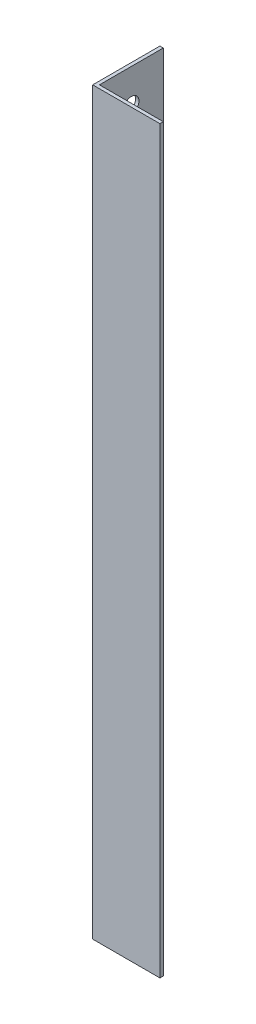
ISO-10303-21;
HEADER;
FILE_DESCRIPTION(('STEP AP214'),'2;1');
FILE_NAME('part.step','',(''),(''),'','','');
FILE_SCHEMA(('AUTOMOTIVE_DESIGN { 1 0 10303 214 1 1 1 1 }'));
ENDSEC;
DATA;
#1=APPLICATION_CONTEXT('core data for automotive mechanical design processes');
#2=APPLICATION_PROTOCOL_DEFINITION('international standard','automotive_design',2000,#1);
#3=PRODUCT_CONTEXT('',#1,'mechanical');
#4=PRODUCT('Part','Part','',(#3));
#5=PRODUCT_RELATED_PRODUCT_CATEGORY('part','',(#4));
#6=PRODUCT_DEFINITION_FORMATION('','',#4);
#7=PRODUCT_DEFINITION_CONTEXT('part definition',#1,'design');
#8=PRODUCT_DEFINITION('design','',#6,#7);
#9=PRODUCT_DEFINITION_SHAPE('','',#8);
#10=(LENGTH_UNIT() NAMED_UNIT(*) SI_UNIT(.MILLI.,.METRE.));
#11=(NAMED_UNIT(*) PLANE_ANGLE_UNIT() SI_UNIT($,.RADIAN.));
#12=(NAMED_UNIT(*) SI_UNIT($,.STERADIAN.) SOLID_ANGLE_UNIT());
#13=UNCERTAINTY_MEASURE_WITH_UNIT(LENGTH_MEASURE(1.E-05),#10,'distance_accuracy_value','');
#14=(GEOMETRIC_REPRESENTATION_CONTEXT(3) GLOBAL_UNCERTAINTY_ASSIGNED_CONTEXT((#13)) GLOBAL_UNIT_ASSIGNED_CONTEXT((#10,
#11,#12)) REPRESENTATION_CONTEXT('',''));
#15=CARTESIAN_POINT('',(0.,0.,0.));
#16=DIRECTION('',(0.,0.,1.));
#17=DIRECTION('',(1.,0.,0.));
#18=AXIS2_PLACEMENT_3D('',#15,#16,#17);
#19=CARTESIAN_POINT('',(20.,220.,0.));
#20=DIRECTION('',(0.,0.,-1.));
#21=DIRECTION('',(-1.,0.,0.));
#22=AXIS2_PLACEMENT_3D('',#19,#20,#21);
#23=PLANE('',#22);
#24=DIRECTION('',(1.,0.,0.));
#25=VECTOR('',#24,1.);
#26=CARTESIAN_POINT('',(20.,0.,0.));
#27=LINE('',#26,#25);
#28=CARTESIAN_POINT('',(0.,0.,0.));
#29=VERTEX_POINT('',#28);
#30=CARTESIAN_POINT('',(20.,0.,0.));
#31=VERTEX_POINT('',#30);
#32=EDGE_CURVE('E123',#29,#31,#27,.T.);
#33=ORIENTED_EDGE('',*,*,#32,.T.);
#34=DIRECTION('',(0.,-1.,0.));
#35=VECTOR('',#34,1.);
#36=CARTESIAN_POINT('',(20.,220.,0.));
#37=LINE('',#36,#35);
#38=CARTESIAN_POINT('',(20.,220.,0.));
#39=VERTEX_POINT('',#38);
#40=EDGE_CURVE('E11',#39,#31,#37,.T.);
#41=ORIENTED_EDGE('',*,*,#40,.F.);
#42=DIRECTION('',(1.,0.,0.));
#43=VECTOR('',#42,1.);
#44=CARTESIAN_POINT('',(20.,220.,0.));
#45=LINE('',#44,#43);
#46=CARTESIAN_POINT('',(0.,220.,0.));
#47=VERTEX_POINT('',#46);
#48=EDGE_CURVE('E134',#47,#39,#45,.T.);
#49=ORIENTED_EDGE('',*,*,#48,.F.);
#50=DIRECTION('',(0.,-1.,0.));
#51=VECTOR('',#50,1.);
#52=CARTESIAN_POINT('',(0.,220.,0.));
#53=LINE('',#52,#51);
#54=EDGE_CURVE('E119',#47,#29,#53,.T.);
#55=ORIENTED_EDGE('',*,*,#54,.T.);
#56=EDGE_LOOP('',(#33,#41,#49,#55));
#57=FACE_BOUND('',#56,.T.);
#58=ADVANCED_FACE('F39',(#57),#23,.F.);
#59=CARTESIAN_POINT('',(20.,220.,-1.));
#60=DIRECTION('',(-1.,0.,0.));
#61=DIRECTION('',(0.,0.,1.));
#62=AXIS2_PLACEMENT_3D('',#59,#60,#61);
#63=PLANE('',#62);
#64=DIRECTION('',(0.,0.,-1.));
#65=VECTOR('',#64,1.);
#66=CARTESIAN_POINT('',(20.,0.,-1.));
#67=LINE('',#66,#65);
#68=CARTESIAN_POINT('',(20.,0.,-1.));
#69=VERTEX_POINT('',#68);
#70=EDGE_CURVE('E126',#31,#69,#67,.T.);
#71=ORIENTED_EDGE('',*,*,#70,.T.);
#72=DIRECTION('',(0.,-1.,0.));
#73=VECTOR('',#72,1.);
#74=CARTESIAN_POINT('',(20.,220.,-1.));
#75=LINE('',#74,#73);
#76=CARTESIAN_POINT('',(20.,220.,-1.));
#77=VERTEX_POINT('',#76);
#78=EDGE_CURVE('E47',#77,#69,#75,.T.);
#79=ORIENTED_EDGE('',*,*,#78,.F.);
#80=DIRECTION('',(0.,0.,-1.));
#81=VECTOR('',#80,1.);
#82=CARTESIAN_POINT('',(20.,220.,-1.));
#83=LINE('',#82,#81);
#84=EDGE_CURVE('E92',#39,#77,#83,.T.);
#85=ORIENTED_EDGE('',*,*,#84,.F.);
#86=ORIENTED_EDGE('',*,*,#40,.T.);
#87=EDGE_LOOP('',(#71,#79,#85,#86));
#88=FACE_BOUND('',#87,.T.);
#89=ADVANCED_FACE('F161',(#88),#63,.F.);
#90=CARTESIAN_POINT('',(1.00000000000001,220.,-1.));
#91=DIRECTION('',(0.,0.,1.));
#92=DIRECTION('',(1.,0.,0.));
#93=AXIS2_PLACEMENT_3D('',#90,#91,#92);
#94=PLANE('',#93);
#95=DIRECTION('',(-1.,0.,0.));
#96=VECTOR('',#95,1.);
#97=CARTESIAN_POINT('',(1.,0.,-1.));
#98=LINE('',#97,#96);
#99=CARTESIAN_POINT('',(1.,0.,-1.));
#100=VERTEX_POINT('',#99);
#101=EDGE_CURVE('E129',#69,#100,#98,.T.);
#102=ORIENTED_EDGE('',*,*,#101,.T.);
#103=DIRECTION('',(0.,-1.,0.));
#104=VECTOR('',#103,1.);
#105=CARTESIAN_POINT('',(1.00000000000001,220.,-1.));
#106=LINE('',#105,#104);
#107=CARTESIAN_POINT('',(1.00000000000001,220.,-1.));
#108=VERTEX_POINT('',#107);
#109=EDGE_CURVE('E114',#108,#100,#106,.T.);
#110=ORIENTED_EDGE('',*,*,#109,.F.);
#111=DIRECTION('',(-1.,0.,0.));
#112=VECTOR('',#111,1.);
#113=CARTESIAN_POINT('',(1.00000000000001,220.,-1.));
#114=LINE('',#113,#112);
#115=EDGE_CURVE('E105',#77,#108,#114,.T.);
#116=ORIENTED_EDGE('',*,*,#115,.F.);
#117=ORIENTED_EDGE('',*,*,#78,.T.);
#118=EDGE_LOOP('',(#102,#110,#116,#117));
#119=FACE_BOUND('',#118,.T.);
#120=ADVANCED_FACE('F140',(#119),#94,.F.);
#121=CARTESIAN_POINT('',(1.00000000000001,220.,-20.));
#122=DIRECTION('',(-1.,0.,0.));
#123=DIRECTION('',(0.,0.,1.));
#124=AXIS2_PLACEMENT_3D('',#121,#122,#123);
#125=PLANE('',#124);
#126=CARTESIAN_POINT('',(0.999999999999997,9.99999999999993,-10.5));
#127=DIRECTION('',(1.,0.,0.));
#128=DIRECTION('',(0.,0.,-1.));
#129=AXIS2_PLACEMENT_3D('',#126,#127,#128);
#130=CIRCLE('',#129,2.24999999999995);
#131=CARTESIAN_POINT('',(0.999999999999997,9.99999999999993,-12.75));
#132=VERTEX_POINT('',#131);
#133=EDGE_CURVE('E177',#132,#132,#130,.T.);
#134=ORIENTED_EDGE('',*,*,#133,.F.);
#135=EDGE_LOOP('',(#134));
#136=FACE_BOUND('',#135,.T.);
#137=CARTESIAN_POINT('',(1.00000000000001,210.,-10.5));
#138=DIRECTION('',(1.,0.,0.));
#139=DIRECTION('',(0.,0.,-1.));
#140=AXIS2_PLACEMENT_3D('',#137,#138,#139);
#141=CIRCLE('',#140,2.25);
#142=CARTESIAN_POINT('',(1.00000000000001,210.,-12.75));
#143=VERTEX_POINT('',#142);
#144=EDGE_CURVE('E181',#143,#143,#141,.T.);
#145=ORIENTED_EDGE('',*,*,#144,.F.);
#146=EDGE_LOOP('',(#145));
#147=FACE_BOUND('',#146,.T.);
#148=CARTESIAN_POINT('',(1.,60.,-10.5));
#149=DIRECTION('',(1.,0.,0.));
#150=DIRECTION('',(0.,0.,-1.));
#151=AXIS2_PLACEMENT_3D('',#148,#149,#150);
#152=CIRCLE('',#151,4.25000000000001);
#153=CARTESIAN_POINT('',(1.,60.,-14.75));
#154=VERTEX_POINT('',#153);
#155=EDGE_CURVE('E185',#154,#154,#152,.T.);
#156=ORIENTED_EDGE('',*,*,#155,.F.);
#157=EDGE_LOOP('',(#156));
#158=FACE_BOUND('',#157,.T.);
#159=CARTESIAN_POINT('',(1.00000000000001,120.,-10.5));
#160=DIRECTION('',(1.,0.,0.));
#161=DIRECTION('',(0.,0.,-1.));
#162=AXIS2_PLACEMENT_3D('',#159,#160,#161);
#163=CIRCLE('',#162,4.25000000000001);
#164=CARTESIAN_POINT('',(1.00000000000001,120.,-14.75));
#165=VERTEX_POINT('',#164);
#166=EDGE_CURVE('E189',#165,#165,#163,.T.);
#167=ORIENTED_EDGE('',*,*,#166,.F.);
#168=EDGE_LOOP('',(#167));
#169=FACE_BOUND('',#168,.T.);
#170=CARTESIAN_POINT('',(1.00000000000001,180.,-10.5));
#171=DIRECTION('',(1.,0.,0.));
#172=DIRECTION('',(0.,0.,-1.));
#173=AXIS2_PLACEMENT_3D('',#170,#171,#172);
#174=CIRCLE('',#173,4.25000000000001);
#175=CARTESIAN_POINT('',(1.00000000000001,180.,-14.75));
#176=VERTEX_POINT('',#175);
#177=EDGE_CURVE('E192',#176,#176,#174,.T.);
#178=ORIENTED_EDGE('',*,*,#177,.F.);
#179=EDGE_LOOP('',(#178));
#180=FACE_BOUND('',#179,.T.);
#181=DIRECTION('',(0.,0.,-1.));
#182=VECTOR('',#181,1.);
#183=CARTESIAN_POINT('',(0.999999999999997,0.,-20.));
#184=LINE('',#183,#182);
#185=CARTESIAN_POINT('',(0.999999999999997,0.,-20.));
#186=VERTEX_POINT('',#185);
#187=EDGE_CURVE('E113',#100,#186,#184,.T.);
#188=ORIENTED_EDGE('',*,*,#187,.T.);
#189=DIRECTION('',(0.,-1.,0.));
#190=VECTOR('',#189,1.);
#191=CARTESIAN_POINT('',(1.00000000000001,220.,-20.));
#192=LINE('',#191,#190);
#193=CARTESIAN_POINT('',(1.00000000000001,220.,-20.));
#194=VERTEX_POINT('',#193);
#195=EDGE_CURVE('E110',#194,#186,#192,.T.);
#196=ORIENTED_EDGE('',*,*,#195,.F.);
#197=DIRECTION('',(0.,0.,-1.));
#198=VECTOR('',#197,1.);
#199=CARTESIAN_POINT('',(1.00000000000001,220.,-20.));
#200=LINE('',#199,#198);
#201=EDGE_CURVE('E99',#108,#194,#200,.T.);
#202=ORIENTED_EDGE('',*,*,#201,.F.);
#203=ORIENTED_EDGE('',*,*,#109,.T.);
#204=EDGE_LOOP('',(#188,#196,#202,#203));
#205=FACE_BOUND('',#204,.T.);
#206=ADVANCED_FACE('F111',(#136,#147,#158,#169,#180,#205),#125,.F.);
#207=CARTESIAN_POINT('',(0.,220.,-20.));
#208=DIRECTION('',(0.,0.,1.));
#209=DIRECTION('',(1.,0.,0.));
#210=AXIS2_PLACEMENT_3D('',#207,#208,#209);
#211=PLANE('',#210);
#212=DIRECTION('',(-1.,0.,0.));
#213=VECTOR('',#212,1.);
#214=CARTESIAN_POINT('',(0.,0.,-20.));
#215=LINE('',#214,#213);
#216=CARTESIAN_POINT('',(0.,0.,-20.));
#217=VERTEX_POINT('',#216);
#218=EDGE_CURVE('E78',#186,#217,#215,.T.);
#219=ORIENTED_EDGE('',*,*,#218,.T.);
#220=DIRECTION('',(0.,-1.,0.));
#221=VECTOR('',#220,1.);
#222=CARTESIAN_POINT('',(0.,220.,-20.));
#223=LINE('',#222,#221);
#224=CARTESIAN_POINT('',(0.,220.,-20.));
#225=VERTEX_POINT('',#224);
#226=EDGE_CURVE('E115',#225,#217,#223,.T.);
#227=ORIENTED_EDGE('',*,*,#226,.F.);
#228=DIRECTION('',(-1.,0.,0.));
#229=VECTOR('',#228,1.);
#230=CARTESIAN_POINT('',(0.,220.,-20.));
#231=LINE('',#230,#229);
#232=EDGE_CURVE('E103',#194,#225,#231,.T.);
#233=ORIENTED_EDGE('',*,*,#232,.F.);
#234=ORIENTED_EDGE('',*,*,#195,.T.);
#235=EDGE_LOOP('',(#219,#227,#233,#234));
#236=FACE_BOUND('',#235,.T.);
#237=ADVANCED_FACE('F117',(#236),#211,.F.);
#238=CARTESIAN_POINT('',(0.,220.,0.));
#239=DIRECTION('',(1.,0.,0.));
#240=DIRECTION('',(0.,0.,-1.));
#241=AXIS2_PLACEMENT_3D('',#238,#239,#240);
#242=PLANE('',#241);
#243=CARTESIAN_POINT('',(0.,9.99999999999993,-10.5));
#244=DIRECTION('',(1.,0.,0.));
#245=DIRECTION('',(0.,0.,-1.));
#246=AXIS2_PLACEMENT_3D('',#243,#244,#245);
#247=CIRCLE('',#246,2.24999999999995);
#248=CARTESIAN_POINT('',(0.,9.99999999999993,-12.75));
#249=VERTEX_POINT('',#248);
#250=EDGE_CURVE('E210',#249,#249,#247,.T.);
#251=ORIENTED_EDGE('',*,*,#250,.T.);
#252=EDGE_LOOP('',(#251));
#253=FACE_BOUND('',#252,.T.);
#254=CARTESIAN_POINT('',(0.,210.,-10.5));
#255=DIRECTION('',(1.,0.,0.));
#256=DIRECTION('',(0.,0.,-1.));
#257=AXIS2_PLACEMENT_3D('',#254,#255,#256);
#258=CIRCLE('',#257,2.25);
#259=CARTESIAN_POINT('',(0.,210.,-12.75));
#260=VERTEX_POINT('',#259);
#261=EDGE_CURVE('E206',#260,#260,#258,.T.);
#262=ORIENTED_EDGE('',*,*,#261,.T.);
#263=EDGE_LOOP('',(#262));
#264=FACE_BOUND('',#263,.T.);
#265=CARTESIAN_POINT('',(0.,60.,-10.5));
#266=DIRECTION('',(1.,0.,0.));
#267=DIRECTION('',(0.,0.,-1.));
#268=AXIS2_PLACEMENT_3D('',#265,#266,#267);
#269=CIRCLE('',#268,4.25000000000001);
#270=CARTESIAN_POINT('',(0.,60.,-14.75));
#271=VERTEX_POINT('',#270);
#272=EDGE_CURVE('E203',#271,#271,#269,.T.);
#273=ORIENTED_EDGE('',*,*,#272,.T.);
#274=EDGE_LOOP('',(#273));
#275=FACE_BOUND('',#274,.T.);
#276=CARTESIAN_POINT('',(0.,120.,-10.5));
#277=DIRECTION('',(1.,0.,0.));
#278=DIRECTION('',(0.,0.,-1.));
#279=AXIS2_PLACEMENT_3D('',#276,#277,#278);
#280=CIRCLE('',#279,4.25000000000001);
#281=CARTESIAN_POINT('',(0.,120.,-14.75));
#282=VERTEX_POINT('',#281);
#283=EDGE_CURVE('E194',#282,#282,#280,.T.);
#284=ORIENTED_EDGE('',*,*,#283,.T.);
#285=EDGE_LOOP('',(#284));
#286=FACE_BOUND('',#285,.T.);
#287=CARTESIAN_POINT('',(0.,180.,-10.5));
#288=DIRECTION('',(1.,0.,0.));
#289=DIRECTION('',(0.,0.,-1.));
#290=AXIS2_PLACEMENT_3D('',#287,#288,#289);
#291=CIRCLE('',#290,4.25000000000001);
#292=CARTESIAN_POINT('',(0.,180.,-14.75));
#293=VERTEX_POINT('',#292);
#294=EDGE_CURVE('E127',#293,#293,#291,.T.);
#295=ORIENTED_EDGE('',*,*,#294,.T.);
#296=EDGE_LOOP('',(#295));
#297=FACE_BOUND('',#296,.T.);
#298=DIRECTION('',(0.,0.,1.));
#299=VECTOR('',#298,1.);
#300=CARTESIAN_POINT('',(0.,0.,0.));
#301=LINE('',#300,#299);
#302=EDGE_CURVE('E84',#217,#29,#301,.T.);
#303=ORIENTED_EDGE('',*,*,#302,.T.);
#304=ORIENTED_EDGE('',*,*,#54,.F.);
#305=DIRECTION('',(0.,0.,1.));
#306=VECTOR('',#305,1.);
#307=CARTESIAN_POINT('',(0.,220.,0.));
#308=LINE('',#307,#306);
#309=EDGE_CURVE('E55',#225,#47,#308,.T.);
#310=ORIENTED_EDGE('',*,*,#309,.F.);
#311=ORIENTED_EDGE('',*,*,#226,.T.);
#312=EDGE_LOOP('',(#303,#304,#310,#311));
#313=FACE_BOUND('',#312,.T.);
#314=ADVANCED_FACE('F147',(#253,#264,#275,#286,#297,#313),#242,.F.);
#315=CARTESIAN_POINT('',(0.,220.,0.));
#316=DIRECTION('',(0.,-1.,0.));
#317=DIRECTION('',(0.,0.,-1.));
#318=AXIS2_PLACEMENT_3D('',#315,#316,#317);
#319=PLANE('',#318);
#320=ORIENTED_EDGE('',*,*,#48,.T.);
#321=ORIENTED_EDGE('',*,*,#84,.T.);
#322=ORIENTED_EDGE('',*,*,#115,.T.);
#323=ORIENTED_EDGE('',*,*,#201,.T.);
#324=ORIENTED_EDGE('',*,*,#232,.T.);
#325=ORIENTED_EDGE('',*,*,#309,.T.);
#326=EDGE_LOOP('',(#320,#321,#322,#323,#324,#325));
#327=FACE_BOUND('',#326,.T.);
#328=ADVANCED_FACE('F101',(#327),#319,.F.);
#329=CARTESIAN_POINT('',(0.,0.,0.));
#330=DIRECTION('',(0.,-1.,0.));
#331=DIRECTION('',(0.,0.,-1.));
#332=AXIS2_PLACEMENT_3D('',#329,#330,#331);
#333=PLANE('',#332);
#334=ORIENTED_EDGE('',*,*,#32,.F.);
#335=ORIENTED_EDGE('',*,*,#302,.F.);
#336=ORIENTED_EDGE('',*,*,#218,.F.);
#337=ORIENTED_EDGE('',*,*,#187,.F.);
#338=ORIENTED_EDGE('',*,*,#101,.F.);
#339=ORIENTED_EDGE('',*,*,#70,.F.);
#340=EDGE_LOOP('',(#334,#335,#336,#337,#338,#339));
#341=FACE_BOUND('',#340,.T.);
#342=ADVANCED_FACE('F143',(#341),#333,.T.);
#343=CARTESIAN_POINT('',(0.,180.,-10.5));
#344=DIRECTION('',(1.,0.,0.));
#345=DIRECTION('',(0.,0.,-1.));
#346=AXIS2_PLACEMENT_3D('',#343,#344,#345);
#347=CYLINDRICAL_SURFACE('',#346,4.25000000000001);
#348=ORIENTED_EDGE('',*,*,#294,.F.);
#349=EDGE_LOOP('',(#348));
#350=FACE_BOUND('',#349,.T.);
#351=ORIENTED_EDGE('',*,*,#177,.T.);
#352=EDGE_LOOP('',(#351));
#353=FACE_BOUND('',#352,.T.);
#354=ADVANCED_FACE('F234',(#350,#353),#347,.F.);
#355=CARTESIAN_POINT('',(0.,120.,-10.5));
#356=DIRECTION('',(1.,0.,0.));
#357=DIRECTION('',(0.,0.,-1.));
#358=AXIS2_PLACEMENT_3D('',#355,#356,#357);
#359=CYLINDRICAL_SURFACE('',#358,4.25000000000001);
#360=ORIENTED_EDGE('',*,*,#283,.F.);
#361=EDGE_LOOP('',(#360));
#362=FACE_BOUND('',#361,.T.);
#363=ORIENTED_EDGE('',*,*,#166,.T.);
#364=EDGE_LOOP('',(#363));
#365=FACE_BOUND('',#364,.T.);
#366=ADVANCED_FACE('F230',(#362,#365),#359,.F.);
#367=CARTESIAN_POINT('',(0.,60.,-10.5));
#368=DIRECTION('',(1.,0.,0.));
#369=DIRECTION('',(0.,0.,-1.));
#370=AXIS2_PLACEMENT_3D('',#367,#368,#369);
#371=CYLINDRICAL_SURFACE('',#370,4.25000000000001);
#372=ORIENTED_EDGE('',*,*,#272,.F.);
#373=EDGE_LOOP('',(#372));
#374=FACE_BOUND('',#373,.T.);
#375=ORIENTED_EDGE('',*,*,#155,.T.);
#376=EDGE_LOOP('',(#375));
#377=FACE_BOUND('',#376,.T.);
#378=ADVANCED_FACE('F224',(#374,#377),#371,.F.);
#379=CARTESIAN_POINT('',(0.,210.,-10.5));
#380=DIRECTION('',(1.,0.,0.));
#381=DIRECTION('',(0.,0.,-1.));
#382=AXIS2_PLACEMENT_3D('',#379,#380,#381);
#383=CYLINDRICAL_SURFACE('',#382,2.25);
#384=ORIENTED_EDGE('',*,*,#261,.F.);
#385=EDGE_LOOP('',(#384));
#386=FACE_BOUND('',#385,.T.);
#387=ORIENTED_EDGE('',*,*,#144,.T.);
#388=EDGE_LOOP('',(#387));
#389=FACE_BOUND('',#388,.T.);
#390=ADVANCED_FACE('F219',(#386,#389),#383,.F.);
#391=CARTESIAN_POINT('',(0.,9.99999999999993,-10.5));
#392=DIRECTION('',(1.,0.,0.));
#393=DIRECTION('',(0.,0.,-1.));
#394=AXIS2_PLACEMENT_3D('',#391,#392,#393);
#395=CYLINDRICAL_SURFACE('',#394,2.24999999999995);
#396=ORIENTED_EDGE('',*,*,#250,.F.);
#397=EDGE_LOOP('',(#396));
#398=FACE_BOUND('',#397,.T.);
#399=ORIENTED_EDGE('',*,*,#133,.T.);
#400=EDGE_LOOP('',(#399));
#401=FACE_BOUND('',#400,.T.);
#402=ADVANCED_FACE('F216',(#398,#401),#395,.F.);
#403=CLOSED_SHELL('',(#58,#89,#120,#206,#237,#314,#328,#342,#354,#366,#378,#390,#402));
#404=MANIFOLD_SOLID_BREP('B2',#403);
#405=ADVANCED_BREP_SHAPE_REPRESENTATION('',(#18,#404),#14);
#406=SHAPE_DEFINITION_REPRESENTATION(#9,#405);
ENDSEC;
END-ISO-10303-21;
